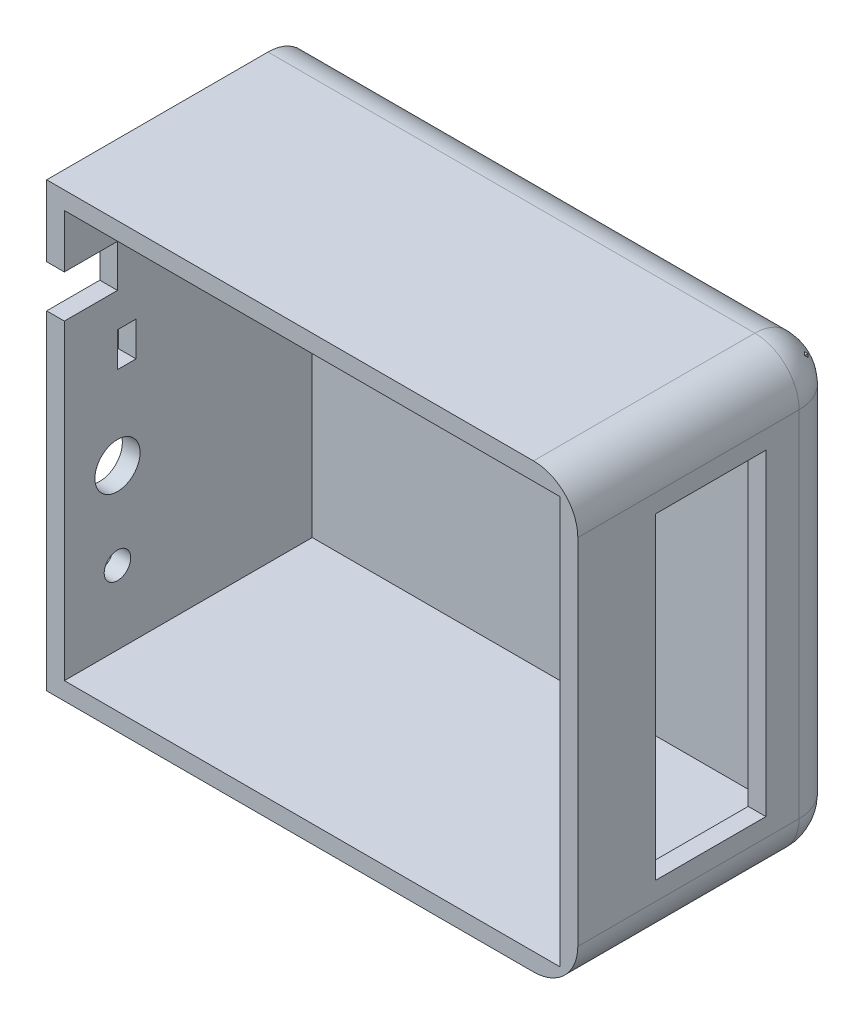
ISO-10303-21;
HEADER;
FILE_DESCRIPTION(('STEP AP214'),'2;1');
FILE_NAME('part.step','',(''),(''),'','','');
FILE_SCHEMA(('AUTOMOTIVE_DESIGN { 1 0 10303 214 1 1 1 1 }'));
ENDSEC;
DATA;
#1=APPLICATION_CONTEXT('core data for automotive mechanical design processes');
#2=APPLICATION_PROTOCOL_DEFINITION('international standard','automotive_design',2000,#1);
#3=PRODUCT_CONTEXT('',#1,'mechanical');
#4=PRODUCT('Part','Part','',(#3));
#5=PRODUCT_RELATED_PRODUCT_CATEGORY('part','',(#4));
#6=PRODUCT_DEFINITION_FORMATION('','',#4);
#7=PRODUCT_DEFINITION_CONTEXT('part definition',#1,'design');
#8=PRODUCT_DEFINITION('design','',#6,#7);
#9=PRODUCT_DEFINITION_SHAPE('','',#8);
#10=(LENGTH_UNIT() NAMED_UNIT(*) SI_UNIT(.MILLI.,.METRE.));
#11=(NAMED_UNIT(*) PLANE_ANGLE_UNIT() SI_UNIT($,.RADIAN.));
#12=(NAMED_UNIT(*) SI_UNIT($,.STERADIAN.) SOLID_ANGLE_UNIT());
#13=UNCERTAINTY_MEASURE_WITH_UNIT(LENGTH_MEASURE(1.E-05),#10,'distance_accuracy_value','');
#14=(GEOMETRIC_REPRESENTATION_CONTEXT(3) GLOBAL_UNCERTAINTY_ASSIGNED_CONTEXT((#13)) GLOBAL_UNIT_ASSIGNED_CONTEXT((#10,
#11,#12)) REPRESENTATION_CONTEXT('',''));
#15=CARTESIAN_POINT('',(0.,0.,0.));
#16=DIRECTION('',(0.,0.,1.));
#17=DIRECTION('',(1.,0.,0.));
#18=AXIS2_PLACEMENT_3D('',#15,#16,#17);
#19=CARTESIAN_POINT('',(0.,0.,4.));
#20=DIRECTION('',(1.,0.,0.));
#21=DIRECTION('',(0.,0.,-1.));
#22=AXIS2_PLACEMENT_3D('',#19,#20,#21);
#23=PLANE('',#22);
#24=CARTESIAN_POINT('',(0.,40.0941932592972,48.));
#25=DIRECTION('',(1.,0.,0.));
#26=DIRECTION('',(0.,0.,-1.));
#27=AXIS2_PLACEMENT_3D('',#24,#25,#26);
#28=CIRCLE('',#27,5.1);
#29=CARTESIAN_POINT('',(0.,40.0941932592972,42.9));
#30=VERTEX_POINT('',#29);
#31=EDGE_CURVE('E224',#30,#30,#28,.F.);
#32=ORIENTED_EDGE('',*,*,#31,.F.);
#33=EDGE_LOOP('',(#32));
#34=FACE_BOUND('',#33,.T.);
#35=DIRECTION('',(0.,1.,0.));
#36=VECTOR('',#35,1.);
#37=CARTESIAN_POINT('',(0.,0.,48.));
#38=LINE('',#37,#36);
#39=CARTESIAN_POINT('',(0.,74.357923225923,48.));
#40=VERTEX_POINT('',#39);
#41=CARTESIAN_POINT('',(0.,83.9579232259231,48.));
#42=VERTEX_POINT('',#41);
#43=EDGE_CURVE('E284',#40,#42,#38,.T.);
#44=ORIENTED_EDGE('',*,*,#43,.T.);
#45=DIRECTION('',(0.,0.,1.));
#46=VECTOR('',#45,1.);
#47=CARTESIAN_POINT('',(0.,83.9579232259231,4.));
#48=LINE('',#47,#46);
#49=CARTESIAN_POINT('',(0.,83.9579232259231,60.));
#50=VERTEX_POINT('',#49);
#51=EDGE_CURVE('E281',#42,#50,#48,.T.);
#52=ORIENTED_EDGE('',*,*,#51,.T.);
#53=DIRECTION('',(0.,-1.,0.));
#54=VECTOR('',#53,1.);
#55=CARTESIAN_POINT('',(0.,0.,60.));
#56=LINE('',#55,#54);
#57=CARTESIAN_POINT('',(0.,100.,60.));
#58=VERTEX_POINT('',#57);
#59=EDGE_CURVE('E325',#58,#50,#56,.T.);
#60=ORIENTED_EDGE('',*,*,#59,.F.);
#61=DIRECTION('',(0.,0.,-1.));
#62=VECTOR('',#61,1.);
#63=CARTESIAN_POINT('',(0.,100.,4.));
#64=LINE('',#63,#62);
#65=CARTESIAN_POINT('',(0.,100.,10.));
#66=VERTEX_POINT('',#65);
#67=EDGE_CURVE('E364',#58,#66,#64,.T.);
#68=ORIENTED_EDGE('',*,*,#67,.T.);
#69=CARTESIAN_POINT('',(0.,90.,10.));
#70=DIRECTION('',(1.,0.,0.));
#71=DIRECTION('',(0.,0.,-1.));
#72=AXIS2_PLACEMENT_3D('',#69,#70,#71);
#73=CIRCLE('',#72,10.);
#74=CARTESIAN_POINT('',(0.,90.,0.));
#75=VERTEX_POINT('',#74);
#76=EDGE_CURVE('E418',#66,#75,#73,.F.);
#77=ORIENTED_EDGE('',*,*,#76,.T.);
#78=DIRECTION('',(0.,-1.,0.));
#79=VECTOR('',#78,1.);
#80=CARTESIAN_POINT('',(0.,0.,0.));
#81=LINE('',#80,#79);
#82=CARTESIAN_POINT('',(0.,10.,0.));
#83=VERTEX_POINT('',#82);
#84=EDGE_CURVE('E362',#75,#83,#81,.T.);
#85=ORIENTED_EDGE('',*,*,#84,.T.);
#86=CARTESIAN_POINT('',(0.,10.,10.));
#87=DIRECTION('',(1.,0.,0.));
#88=DIRECTION('',(0.,0.,-1.));
#89=AXIS2_PLACEMENT_3D('',#86,#87,#88);
#90=CIRCLE('',#89,10.);
#91=CARTESIAN_POINT('',(0.,0.,10.));
#92=VERTEX_POINT('',#91);
#93=EDGE_CURVE('E400',#83,#92,#90,.F.);
#94=ORIENTED_EDGE('',*,*,#93,.T.);
#95=DIRECTION('',(0.,0.,-1.));
#96=VECTOR('',#95,1.);
#97=CARTESIAN_POINT('',(0.,0.,4.));
#98=LINE('',#97,#96);
#99=CARTESIAN_POINT('',(0.,0.,60.));
#100=VERTEX_POINT('',#99);
#101=EDGE_CURVE('E367',#100,#92,#98,.T.);
#102=ORIENTED_EDGE('',*,*,#101,.F.);
#103=CARTESIAN_POINT('',(0.,74.357923225923,60.));
#104=VERTEX_POINT('',#103);
#105=EDGE_CURVE('E324',#104,#100,#56,.T.);
#106=ORIENTED_EDGE('',*,*,#105,.F.);
#107=DIRECTION('',(0.,0.,1.));
#108=VECTOR('',#107,1.);
#109=CARTESIAN_POINT('',(0.,74.357923225923,4.));
#110=LINE('',#109,#108);
#111=EDGE_CURVE('E277',#40,#104,#110,.T.);
#112=ORIENTED_EDGE('',*,*,#111,.F.);
#113=EDGE_LOOP('',(#44,#52,#60,#68,#77,#85,#94,#102,#106,#112));
#114=FACE_BOUND('',#113,.T.);
#115=DIRECTION('',(0.,1.,0.));
#116=VECTOR('',#115,1.);
#117=CARTESIAN_POINT('',(0.,0.,48.));
#118=LINE('',#117,#116);
#119=CARTESIAN_POINT('',(0.,58.8579232259231,48.));
#120=VERTEX_POINT('',#119);
#121=CARTESIAN_POINT('',(0.,66.6579232259231,48.));
#122=VERTEX_POINT('',#121);
#123=EDGE_CURVE('E261',#120,#122,#118,.T.);
#124=ORIENTED_EDGE('',*,*,#123,.F.);
#125=DIRECTION('',(0.,0.,1.));
#126=VECTOR('',#125,1.);
#127=CARTESIAN_POINT('',(0.,58.8579232259231,4.));
#128=LINE('',#127,#126);
#129=CARTESIAN_POINT('',(0.,58.8579232259231,43.8));
#130=VERTEX_POINT('',#129);
#131=EDGE_CURVE('E247',#130,#120,#128,.T.);
#132=ORIENTED_EDGE('',*,*,#131,.F.);
#133=DIRECTION('',(0.,1.,0.));
#134=VECTOR('',#133,1.);
#135=CARTESIAN_POINT('',(0.,0.,43.8));
#136=LINE('',#135,#134);
#137=CARTESIAN_POINT('',(0.,66.6579232259231,43.8));
#138=VERTEX_POINT('',#137);
#139=EDGE_CURVE('E215',#130,#138,#136,.T.);
#140=ORIENTED_EDGE('',*,*,#139,.T.);
#141=DIRECTION('',(0.,0.,1.));
#142=VECTOR('',#141,1.);
#143=CARTESIAN_POINT('',(0.,66.6579232259231,4.));
#144=LINE('',#143,#142);
#145=EDGE_CURVE('E213',#138,#122,#144,.T.);
#146=ORIENTED_EDGE('',*,*,#145,.T.);
#147=EDGE_LOOP('',(#124,#132,#140,#146));
#148=FACE_BOUND('',#147,.T.);
#149=CARTESIAN_POINT('',(0.,20.5603193344936,48.));
#150=DIRECTION('',(1.,0.,0.));
#151=DIRECTION('',(0.,0.,-1.));
#152=AXIS2_PLACEMENT_3D('',#149,#150,#151);
#153=CIRCLE('',#152,3.);
#154=CARTESIAN_POINT('',(0.,20.5603193344936,45.));
#155=VERTEX_POINT('',#154);
#156=EDGE_CURVE('E225',#155,#155,#153,.F.);
#157=ORIENTED_EDGE('',*,*,#156,.F.);
#158=EDGE_LOOP('',(#157));
#159=FACE_BOUND('',#158,.T.);
#160=ADVANCED_FACE('F40',(#34,#114,#148,#159),#23,.F.);
#161=CARTESIAN_POINT('',(4.00000000000001,0.,60.));
#162=DIRECTION('',(1.,0.,0.));
#163=DIRECTION('',(0.,1.,0.));
#164=AXIS2_PLACEMENT_3D('',#161,#162,#163);
#165=PLANE('',#164);
#166=CARTESIAN_POINT('',(4.00000000000001,40.0941932592972,48.));
#167=DIRECTION('',(1.,0.,0.));
#168=DIRECTION('',(0.,1.,0.));
#169=AXIS2_PLACEMENT_3D('',#166,#167,#168);
#170=CIRCLE('',#169,5.1);
#171=CARTESIAN_POINT('',(4.00000000000001,45.1941932592972,48.));
#172=VERTEX_POINT('',#171);
#173=EDGE_CURVE('E222',#172,#172,#170,.F.);
#174=ORIENTED_EDGE('',*,*,#173,.T.);
#175=EDGE_LOOP('',(#174));
#176=FACE_BOUND('',#175,.T.);
#177=DIRECTION('',(0.,0.,1.));
#178=VECTOR('',#177,1.);
#179=CARTESIAN_POINT('',(4.,83.9579232259231,60.));
#180=LINE('',#179,#178);
#181=CARTESIAN_POINT('',(4.,83.9579232259231,48.));
#182=VERTEX_POINT('',#181);
#183=CARTESIAN_POINT('',(4.00000000000001,83.9579232259231,60.));
#184=VERTEX_POINT('',#183);
#185=EDGE_CURVE('E278',#182,#184,#180,.T.);
#186=ORIENTED_EDGE('',*,*,#185,.F.);
#187=DIRECTION('',(0.,1.,0.));
#188=VECTOR('',#187,1.);
#189=CARTESIAN_POINT('',(4.00000000000001,0.,48.));
#190=LINE('',#189,#188);
#191=CARTESIAN_POINT('',(4.,74.357923225923,48.));
#192=VERTEX_POINT('',#191);
#193=EDGE_CURVE('E206',#192,#182,#190,.T.);
#194=ORIENTED_EDGE('',*,*,#193,.F.);
#195=DIRECTION('',(0.,0.,1.));
#196=VECTOR('',#195,1.);
#197=CARTESIAN_POINT('',(4.,74.357923225923,60.));
#198=LINE('',#197,#196);
#199=CARTESIAN_POINT('',(4.00000000000001,74.357923225923,60.));
#200=VERTEX_POINT('',#199);
#201=EDGE_CURVE('E274',#192,#200,#198,.T.);
#202=ORIENTED_EDGE('',*,*,#201,.T.);
#203=DIRECTION('',(0.,-1.,0.));
#204=VECTOR('',#203,1.);
#205=CARTESIAN_POINT('',(4.00000000000001,0.,60.));
#206=LINE('',#205,#204);
#207=CARTESIAN_POINT('',(4.00000000000001,3.99999999999999,60.));
#208=VERTEX_POINT('',#207);
#209=EDGE_CURVE('E328',#200,#208,#206,.T.);
#210=ORIENTED_EDGE('',*,*,#209,.T.);
#211=DIRECTION('',(0.,0.,-1.));
#212=VECTOR('',#211,1.);
#213=CARTESIAN_POINT('',(4.00000000000001,3.99999999999999,60.));
#214=LINE('',#213,#212);
#215=CARTESIAN_POINT('',(4.00000000000001,3.99999999999999,4.));
#216=VERTEX_POINT('',#215);
#217=EDGE_CURVE('E340',#208,#216,#214,.T.);
#218=ORIENTED_EDGE('',*,*,#217,.T.);
#219=DIRECTION('',(0.,-1.,0.));
#220=VECTOR('',#219,1.);
#221=CARTESIAN_POINT('',(4.00000000000001,0.,4.));
#222=LINE('',#221,#220);
#223=CARTESIAN_POINT('',(4.,96.,4.));
#224=VERTEX_POINT('',#223);
#225=EDGE_CURVE('E359',#224,#216,#222,.T.);
#226=ORIENTED_EDGE('',*,*,#225,.F.);
#227=DIRECTION('',(0.,0.,-1.));
#228=VECTOR('',#227,1.);
#229=CARTESIAN_POINT('',(4.,96.,60.));
#230=LINE('',#229,#228);
#231=CARTESIAN_POINT('',(4.,96.,60.));
#232=VERTEX_POINT('',#231);
#233=EDGE_CURVE('E348',#232,#224,#230,.T.);
#234=ORIENTED_EDGE('',*,*,#233,.F.);
#235=EDGE_CURVE('E329',#232,#184,#206,.T.);
#236=ORIENTED_EDGE('',*,*,#235,.T.);
#237=EDGE_LOOP('',(#186,#194,#202,#210,#218,#226,#234,#236));
#238=FACE_BOUND('',#237,.T.);
#239=DIRECTION('',(0.,0.,1.));
#240=VECTOR('',#239,1.);
#241=CARTESIAN_POINT('',(4.00000000000001,58.8579232259231,60.));
#242=LINE('',#241,#240);
#243=CARTESIAN_POINT('',(4.00000000000001,58.8579232259231,43.8));
#244=VERTEX_POINT('',#243);
#245=CARTESIAN_POINT('',(4.00000000000001,58.8579232259231,48.));
#246=VERTEX_POINT('',#245);
#247=EDGE_CURVE('E49',#244,#246,#242,.T.);
#248=ORIENTED_EDGE('',*,*,#247,.T.);
#249=DIRECTION('',(0.,1.,0.));
#250=VECTOR('',#249,1.);
#251=CARTESIAN_POINT('',(4.00000000000001,0.,48.));
#252=LINE('',#251,#250);
#253=CARTESIAN_POINT('',(4.,66.6579232259231,48.));
#254=VERTEX_POINT('',#253);
#255=EDGE_CURVE('E12',#246,#254,#252,.T.);
#256=ORIENTED_EDGE('',*,*,#255,.T.);
#257=DIRECTION('',(0.,0.,1.));
#258=VECTOR('',#257,1.);
#259=CARTESIAN_POINT('',(4.,66.6579232259231,60.));
#260=LINE('',#259,#258);
#261=CARTESIAN_POINT('',(4.,66.6579232259231,43.8));
#262=VERTEX_POINT('',#261);
#263=EDGE_CURVE('E205',#262,#254,#260,.T.);
#264=ORIENTED_EDGE('',*,*,#263,.F.);
#265=DIRECTION('',(0.,1.,0.));
#266=VECTOR('',#265,1.);
#267=CARTESIAN_POINT('',(4.00000000000001,0.,43.8));
#268=LINE('',#267,#266);
#269=EDGE_CURVE('E200',#244,#262,#268,.T.);
#270=ORIENTED_EDGE('',*,*,#269,.F.);
#271=EDGE_LOOP('',(#248,#256,#264,#270));
#272=FACE_BOUND('',#271,.T.);
#273=CARTESIAN_POINT('',(4.00000000000001,20.5603193344936,48.));
#274=DIRECTION('',(1.,0.,0.));
#275=DIRECTION('',(0.,1.,0.));
#276=AXIS2_PLACEMENT_3D('',#273,#274,#275);
#277=CIRCLE('',#276,3.);
#278=CARTESIAN_POINT('',(4.00000000000001,23.5603193344936,48.));
#279=VERTEX_POINT('',#278);
#280=EDGE_CURVE('E44',#279,#279,#277,.F.);
#281=ORIENTED_EDGE('',*,*,#280,.T.);
#282=EDGE_LOOP('',(#281));
#283=FACE_BOUND('',#282,.T.);
#284=ADVANCED_FACE('F217',(#176,#238,#272,#283),#165,.T.);
#285=CARTESIAN_POINT('',(120.,0.,4.));
#286=DIRECTION('',(-1.,0.,0.));
#287=DIRECTION('',(0.,0.,1.));
#288=AXIS2_PLACEMENT_3D('',#285,#286,#287);
#289=PLANE('',#288);
#290=DIRECTION('',(0.,1.,0.));
#291=VECTOR('',#290,1.);
#292=CARTESIAN_POINT('',(120.,100.,10.));
#293=LINE('',#292,#291);
#294=CARTESIAN_POINT('',(120.,9.99999999999999,10.));
#295=VERTEX_POINT('',#294);
#296=CARTESIAN_POINT('',(120.,90.,10.));
#297=VERTEX_POINT('',#296);
#298=EDGE_CURVE('E379',#295,#297,#293,.T.);
#299=ORIENTED_EDGE('',*,*,#298,.T.);
#300=DIRECTION('',(0.,0.,-1.));
#301=VECTOR('',#300,1.);
#302=CARTESIAN_POINT('',(120.,90.,4.));
#303=LINE('',#302,#301);
#304=CARTESIAN_POINT('',(120.,90.,60.));
#305=VERTEX_POINT('',#304);
#306=EDGE_CURVE('E412',#297,#305,#303,.F.);
#307=ORIENTED_EDGE('',*,*,#306,.T.);
#308=DIRECTION('',(0.,-1.,0.));
#309=VECTOR('',#308,1.);
#310=CARTESIAN_POINT('',(120.,0.,60.));
#311=LINE('',#310,#309);
#312=CARTESIAN_POINT('',(120.,10.,60.));
#313=VERTEX_POINT('',#312);
#314=EDGE_CURVE('E319',#305,#313,#311,.T.);
#315=ORIENTED_EDGE('',*,*,#314,.T.);
#316=DIRECTION('',(0.,0.,-1.));
#317=VECTOR('',#316,1.);
#318=CARTESIAN_POINT('',(120.,10.,4.));
#319=LINE('',#318,#317);
#320=EDGE_CURVE('E384',#313,#295,#319,.T.);
#321=ORIENTED_EDGE('',*,*,#320,.T.);
#322=EDGE_LOOP('',(#299,#307,#315,#321));
#323=FACE_BOUND('',#322,.T.);
#324=DIRECTION('',(0.,0.,-1.));
#325=VECTOR('',#324,1.);
#326=CARTESIAN_POINT('',(120.,14.15,4.));
#327=LINE('',#326,#325);
#328=CARTESIAN_POINT('',(120.,14.15,42.5));
#329=VERTEX_POINT('',#328);
#330=CARTESIAN_POINT('',(120.,14.15,17.5));
#331=VERTEX_POINT('',#330);
#332=EDGE_CURVE('E314',#329,#331,#327,.T.);
#333=ORIENTED_EDGE('',*,*,#332,.F.);
#334=DIRECTION('',(0.,-1.,0.));
#335=VECTOR('',#334,1.);
#336=CARTESIAN_POINT('',(120.,0.,42.5));
#337=LINE('',#336,#335);
#338=CARTESIAN_POINT('',(120.,85.85,42.5));
#339=VERTEX_POINT('',#338);
#340=EDGE_CURVE('E301',#339,#329,#337,.T.);
#341=ORIENTED_EDGE('',*,*,#340,.F.);
#342=DIRECTION('',(0.,0.,1.));
#343=VECTOR('',#342,1.);
#344=CARTESIAN_POINT('',(120.,85.85,4.));
#345=LINE('',#344,#343);
#346=CARTESIAN_POINT('',(120.,85.85,17.5));
#347=VERTEX_POINT('',#346);
#348=EDGE_CURVE('E303',#347,#339,#345,.T.);
#349=ORIENTED_EDGE('',*,*,#348,.F.);
#350=DIRECTION('',(0.,1.,0.));
#351=VECTOR('',#350,1.);
#352=CARTESIAN_POINT('',(120.,0.,17.5));
#353=LINE('',#352,#351);
#354=EDGE_CURVE('E312',#331,#347,#353,.T.);
#355=ORIENTED_EDGE('',*,*,#354,.F.);
#356=EDGE_LOOP('',(#333,#341,#349,#355));
#357=FACE_BOUND('',#356,.T.);
#358=ADVANCED_FACE('F468',(#323,#357),#289,.F.);
#359=CARTESIAN_POINT('',(116.,0.,60.));
#360=DIRECTION('',(1.,0.,0.));
#361=DIRECTION('',(0.,1.,0.));
#362=AXIS2_PLACEMENT_3D('',#359,#360,#361);
#363=PLANE('',#362);
#364=DIRECTION('',(0.,0.,-1.));
#365=VECTOR('',#364,1.);
#366=CARTESIAN_POINT('',(116.,96.,60.));
#367=LINE('',#366,#365);
#368=CARTESIAN_POINT('',(116.,96.,60.));
#369=VERTEX_POINT('',#368);
#370=CARTESIAN_POINT('',(116.,96.,4.));
#371=VERTEX_POINT('',#370);
#372=EDGE_CURVE('E345',#369,#371,#367,.T.);
#373=ORIENTED_EDGE('',*,*,#372,.T.);
#374=DIRECTION('',(0.,-1.,0.));
#375=VECTOR('',#374,1.);
#376=CARTESIAN_POINT('',(116.,0.,4.));
#377=LINE('',#376,#375);
#378=CARTESIAN_POINT('',(116.,3.99999999999999,4.));
#379=VERTEX_POINT('',#378);
#380=EDGE_CURVE('E354',#371,#379,#377,.T.);
#381=ORIENTED_EDGE('',*,*,#380,.T.);
#382=DIRECTION('',(0.,0.,-1.));
#383=VECTOR('',#382,1.);
#384=CARTESIAN_POINT('',(116.,3.99999999999999,60.));
#385=LINE('',#384,#383);
#386=CARTESIAN_POINT('',(116.,3.99999999999999,60.));
#387=VERTEX_POINT('',#386);
#388=EDGE_CURVE('E343',#387,#379,#385,.T.);
#389=ORIENTED_EDGE('',*,*,#388,.F.);
#390=DIRECTION('',(0.,-1.,0.));
#391=VECTOR('',#390,1.);
#392=CARTESIAN_POINT('',(116.,0.,60.));
#393=LINE('',#392,#391);
#394=EDGE_CURVE('E335',#369,#387,#393,.T.);
#395=ORIENTED_EDGE('',*,*,#394,.F.);
#396=EDGE_LOOP('',(#373,#381,#389,#395));
#397=FACE_BOUND('',#396,.T.);
#398=DIRECTION('',(0.,0.,1.));
#399=VECTOR('',#398,1.);
#400=CARTESIAN_POINT('',(116.,14.15,60.));
#401=LINE('',#400,#399);
#402=CARTESIAN_POINT('',(116.,14.15,17.5));
#403=VERTEX_POINT('',#402);
#404=CARTESIAN_POINT('',(116.,14.15,42.5));
#405=VERTEX_POINT('',#404);
#406=EDGE_CURVE('E376',#403,#405,#401,.T.);
#407=ORIENTED_EDGE('',*,*,#406,.F.);
#408=DIRECTION('',(0.,-1.,0.));
#409=VECTOR('',#408,1.);
#410=CARTESIAN_POINT('',(116.,0.,17.5));
#411=LINE('',#410,#409);
#412=CARTESIAN_POINT('',(116.,85.85,17.5));
#413=VERTEX_POINT('',#412);
#414=EDGE_CURVE('E374',#413,#403,#411,.T.);
#415=ORIENTED_EDGE('',*,*,#414,.F.);
#416=DIRECTION('',(0.,0.,-1.));
#417=VECTOR('',#416,1.);
#418=CARTESIAN_POINT('',(116.,85.85,60.));
#419=LINE('',#418,#417);
#420=CARTESIAN_POINT('',(116.,85.85,42.5));
#421=VERTEX_POINT('',#420);
#422=EDGE_CURVE('E372',#421,#413,#419,.T.);
#423=ORIENTED_EDGE('',*,*,#422,.F.);
#424=DIRECTION('',(0.,1.,0.));
#425=VECTOR('',#424,1.);
#426=CARTESIAN_POINT('',(116.,0.,42.5));
#427=LINE('',#426,#425);
#428=EDGE_CURVE('E370',#405,#421,#427,.T.);
#429=ORIENTED_EDGE('',*,*,#428,.F.);
#430=EDGE_LOOP('',(#407,#415,#423,#429));
#431=FACE_BOUND('',#430,.T.);
#432=ADVANCED_FACE('F464',(#397,#431),#363,.F.);
#433=CARTESIAN_POINT('',(0.,0.,4.));
#434=DIRECTION('',(0.,1.,0.));
#435=DIRECTION('',(0.,0.,1.));
#436=AXIS2_PLACEMENT_3D('',#433,#434,#435);
#437=PLANE('',#436);
#438=DIRECTION('',(1.,0.,0.));
#439=VECTOR('',#438,1.);
#440=CARTESIAN_POINT('',(110.,0.,10.));
#441=LINE('',#440,#439);
#442=CARTESIAN_POINT('',(110.,0.,10.));
#443=VERTEX_POINT('',#442);
#444=EDGE_CURVE('E387',#92,#443,#441,.T.);
#445=ORIENTED_EDGE('',*,*,#444,.T.);
#446=DIRECTION('',(0.,0.,-1.));
#447=VECTOR('',#446,1.);
#448=CARTESIAN_POINT('',(110.,0.,4.));
#449=LINE('',#448,#447);
#450=CARTESIAN_POINT('',(110.,0.,60.));
#451=VERTEX_POINT('',#450);
#452=EDGE_CURVE('E389',#443,#451,#449,.F.);
#453=ORIENTED_EDGE('',*,*,#452,.T.);
#454=DIRECTION('',(1.,0.,0.));
#455=VECTOR('',#454,1.);
#456=CARTESIAN_POINT('',(0.,0.,60.));
#457=LINE('',#456,#455);
#458=EDGE_CURVE('E316',#100,#451,#457,.T.);
#459=ORIENTED_EDGE('',*,*,#458,.F.);
#460=ORIENTED_EDGE('',*,*,#101,.T.);
#461=EDGE_LOOP('',(#445,#453,#459,#460));
#462=FACE_BOUND('',#461,.T.);
#463=ADVANCED_FACE('F467',(#462),#437,.F.);
#464=CARTESIAN_POINT('',(0.,100.,4.));
#465=DIRECTION('',(0.,-1.,0.));
#466=DIRECTION('',(0.,0.,-1.));
#467=AXIS2_PLACEMENT_3D('',#464,#465,#466);
#468=PLANE('',#467);
#469=DIRECTION('',(1.,0.,0.));
#470=VECTOR('',#469,1.);
#471=CARTESIAN_POINT('',(0.,100.,60.));
#472=LINE('',#471,#470);
#473=CARTESIAN_POINT('',(110.,100.,60.));
#474=VERTEX_POINT('',#473);
#475=EDGE_CURVE('E321',#58,#474,#472,.T.);
#476=ORIENTED_EDGE('',*,*,#475,.T.);
#477=DIRECTION('',(0.,0.,-1.));
#478=VECTOR('',#477,1.);
#479=CARTESIAN_POINT('',(110.,100.,4.));
#480=LINE('',#479,#478);
#481=CARTESIAN_POINT('',(110.,100.,10.));
#482=VERTEX_POINT('',#481);
#483=EDGE_CURVE('E409',#474,#482,#480,.T.);
#484=ORIENTED_EDGE('',*,*,#483,.T.);
#485=DIRECTION('',(-1.,0.,0.));
#486=VECTOR('',#485,1.);
#487=CARTESIAN_POINT('',(0.,100.,10.));
#488=LINE('',#487,#486);
#489=EDGE_CURVE('E402',#482,#66,#488,.T.);
#490=ORIENTED_EDGE('',*,*,#489,.T.);
#491=ORIENTED_EDGE('',*,*,#67,.F.);
#492=EDGE_LOOP('',(#476,#484,#490,#491));
#493=FACE_BOUND('',#492,.T.);
#494=ADVANCED_FACE('F548',(#493),#468,.F.);
#495=CARTESIAN_POINT('',(0.,0.,0.));
#496=DIRECTION('',(0.,0.,-1.));
#497=DIRECTION('',(-1.,0.,0.));
#498=AXIS2_PLACEMENT_3D('',#495,#496,#497);
#499=PLANE('',#498);
#500=ORIENTED_EDGE('',*,*,#84,.F.);
#501=DIRECTION('',(-1.,0.,0.));
#502=VECTOR('',#501,1.);
#503=CARTESIAN_POINT('',(110.,90.,0.));
#504=LINE('',#503,#502);
#505=CARTESIAN_POINT('',(110.,90.,0.));
#506=VERTEX_POINT('',#505);
#507=EDGE_CURVE('E420',#75,#506,#504,.F.);
#508=ORIENTED_EDGE('',*,*,#507,.T.);
#509=DIRECTION('',(0.,1.,0.));
#510=VECTOR('',#509,1.);
#511=CARTESIAN_POINT('',(110.,0.,0.));
#512=LINE('',#511,#510);
#513=CARTESIAN_POINT('',(110.,10.,0.));
#514=VERTEX_POINT('',#513);
#515=EDGE_CURVE('E382',#506,#514,#512,.F.);
#516=ORIENTED_EDGE('',*,*,#515,.T.);
#517=DIRECTION('',(1.,0.,0.));
#518=VECTOR('',#517,1.);
#519=CARTESIAN_POINT('',(0.,10.,0.));
#520=LINE('',#519,#518);
#521=EDGE_CURVE('E397',#514,#83,#520,.F.);
#522=ORIENTED_EDGE('',*,*,#521,.T.);
#523=EDGE_LOOP('',(#500,#508,#516,#522));
#524=FACE_BOUND('',#523,.T.);
#525=ADVANCED_FACE('F553',(#524),#499,.T.);
#526=CARTESIAN_POINT('',(0.,96.,60.));
#527=DIRECTION('',(0.,1.,0.));
#528=DIRECTION('',(0.,0.,1.));
#529=AXIS2_PLACEMENT_3D('',#526,#527,#528);
#530=PLANE('',#529);
#531=ORIENTED_EDGE('',*,*,#233,.T.);
#532=DIRECTION('',(1.,0.,0.));
#533=VECTOR('',#532,1.);
#534=CARTESIAN_POINT('',(0.,96.,4.));
#535=LINE('',#534,#533);
#536=EDGE_CURVE('E357',#224,#371,#535,.T.);
#537=ORIENTED_EDGE('',*,*,#536,.T.);
#538=ORIENTED_EDGE('',*,*,#372,.F.);
#539=DIRECTION('',(1.,0.,0.));
#540=VECTOR('',#539,1.);
#541=CARTESIAN_POINT('',(0.,96.,60.));
#542=LINE('',#541,#540);
#543=EDGE_CURVE('E332',#232,#369,#542,.T.);
#544=ORIENTED_EDGE('',*,*,#543,.F.);
#545=EDGE_LOOP('',(#531,#537,#538,#544));
#546=FACE_BOUND('',#545,.T.);
#547=ADVANCED_FACE('F462',(#546),#530,.F.);
#548=CARTESIAN_POINT('',(0.,3.99999999999999,60.));
#549=DIRECTION('',(0.,1.,0.));
#550=DIRECTION('',(0.,0.,1.));
#551=AXIS2_PLACEMENT_3D('',#548,#549,#550);
#552=PLANE('',#551);
#553=DIRECTION('',(1.,0.,0.));
#554=VECTOR('',#553,1.);
#555=CARTESIAN_POINT('',(0.,3.99999999999999,4.));
#556=LINE('',#555,#554);
#557=EDGE_CURVE('E351',#216,#379,#556,.T.);
#558=ORIENTED_EDGE('',*,*,#557,.F.);
#559=ORIENTED_EDGE('',*,*,#217,.F.);
#560=DIRECTION('',(1.,0.,0.));
#561=VECTOR('',#560,1.);
#562=CARTESIAN_POINT('',(0.,3.99999999999999,60.));
#563=LINE('',#562,#561);
#564=EDGE_CURVE('E337',#208,#387,#563,.T.);
#565=ORIENTED_EDGE('',*,*,#564,.T.);
#566=ORIENTED_EDGE('',*,*,#388,.T.);
#567=EDGE_LOOP('',(#558,#559,#565,#566));
#568=FACE_BOUND('',#567,.T.);
#569=ADVANCED_FACE('F456',(#568),#552,.T.);
#570=CARTESIAN_POINT('',(0.,0.,60.));
#571=DIRECTION('',(0.,0.,1.));
#572=DIRECTION('',(1.,0.,0.));
#573=AXIS2_PLACEMENT_3D('',#570,#571,#572);
#574=PLANE('',#573);
#575=DIRECTION('',(-1.,0.,0.));
#576=VECTOR('',#575,1.);
#577=CARTESIAN_POINT('',(0.,83.9579232259231,60.));
#578=LINE('',#577,#576);
#579=EDGE_CURVE('E428',#184,#50,#578,.T.);
#580=ORIENTED_EDGE('',*,*,#579,.F.);
#581=ORIENTED_EDGE('',*,*,#235,.F.);
#582=ORIENTED_EDGE('',*,*,#543,.T.);
#583=ORIENTED_EDGE('',*,*,#394,.T.);
#584=ORIENTED_EDGE('',*,*,#564,.F.);
#585=ORIENTED_EDGE('',*,*,#209,.F.);
#586=DIRECTION('',(-1.,0.,0.));
#587=VECTOR('',#586,1.);
#588=CARTESIAN_POINT('',(0.,74.357923225923,60.));
#589=LINE('',#588,#587);
#590=EDGE_CURVE('E422',#200,#104,#589,.T.);
#591=ORIENTED_EDGE('',*,*,#590,.T.);
#592=ORIENTED_EDGE('',*,*,#105,.T.);
#593=ORIENTED_EDGE('',*,*,#458,.T.);
#594=CARTESIAN_POINT('',(110.,10.,60.));
#595=DIRECTION('',(0.,0.,1.));
#596=DIRECTION('',(1.,0.,0.));
#597=AXIS2_PLACEMENT_3D('',#594,#595,#596);
#598=CIRCLE('',#597,10.);
#599=EDGE_CURVE('E391',#451,#313,#598,.T.);
#600=ORIENTED_EDGE('',*,*,#599,.T.);
#601=ORIENTED_EDGE('',*,*,#314,.F.);
#602=CARTESIAN_POINT('',(110.,90.,60.));
#603=DIRECTION('',(0.,0.,1.));
#604=DIRECTION('',(1.,0.,0.));
#605=AXIS2_PLACEMENT_3D('',#602,#603,#604);
#606=CIRCLE('',#605,10.);
#607=EDGE_CURVE('E414',#305,#474,#606,.T.);
#608=ORIENTED_EDGE('',*,*,#607,.T.);
#609=ORIENTED_EDGE('',*,*,#475,.F.);
#610=ORIENTED_EDGE('',*,*,#59,.T.);
#611=EDGE_LOOP('',(#580,#581,#582,#583,#584,#585,#591,#592,#593,#600,#601,#608,#609,#610));
#612=FACE_BOUND('',#611,.T.);
#613=ADVANCED_FACE('F442',(#612),#574,.T.);
#614=CARTESIAN_POINT('',(0.,0.,4.));
#615=DIRECTION('',(0.,0.,-1.));
#616=DIRECTION('',(-1.,0.,0.));
#617=AXIS2_PLACEMENT_3D('',#614,#615,#616);
#618=PLANE('',#617);
#619=ORIENTED_EDGE('',*,*,#536,.F.);
#620=ORIENTED_EDGE('',*,*,#225,.T.);
#621=ORIENTED_EDGE('',*,*,#557,.T.);
#622=ORIENTED_EDGE('',*,*,#380,.F.);
#623=EDGE_LOOP('',(#619,#620,#621,#622));
#624=FACE_BOUND('',#623,.T.);
#625=ADVANCED_FACE('F459',(#624),#618,.F.);
#626=CARTESIAN_POINT('',(120.,14.15,17.5));
#627=DIRECTION('',(0.,1.,0.));
#628=DIRECTION('',(0.,0.,1.));
#629=AXIS2_PLACEMENT_3D('',#626,#627,#628);
#630=PLANE('',#629);
#631=ORIENTED_EDGE('',*,*,#332,.T.);
#632=DIRECTION('',(1.,0.,0.));
#633=VECTOR('',#632,1.);
#634=CARTESIAN_POINT('',(120.,14.15,17.5));
#635=LINE('',#634,#633);
#636=EDGE_CURVE('E298',#403,#331,#635,.T.);
#637=ORIENTED_EDGE('',*,*,#636,.F.);
#638=ORIENTED_EDGE('',*,*,#406,.T.);
#639=DIRECTION('',(1.,0.,0.));
#640=VECTOR('',#639,1.);
#641=CARTESIAN_POINT('',(120.,14.15,42.5));
#642=LINE('',#641,#640);
#643=EDGE_CURVE('E293',#405,#329,#642,.T.);
#644=ORIENTED_EDGE('',*,*,#643,.T.);
#645=EDGE_LOOP('',(#631,#637,#638,#644));
#646=FACE_BOUND('',#645,.T.);
#647=ADVANCED_FACE('F476',(#646),#630,.T.);
#648=CARTESIAN_POINT('',(120.,14.15,17.5));
#649=DIRECTION('',(0.,0.,1.));
#650=DIRECTION('',(1.,0.,0.));
#651=AXIS2_PLACEMENT_3D('',#648,#649,#650);
#652=PLANE('',#651);
#653=ORIENTED_EDGE('',*,*,#354,.T.);
#654=DIRECTION('',(1.,0.,0.));
#655=VECTOR('',#654,1.);
#656=CARTESIAN_POINT('',(120.,85.85,17.5));
#657=LINE('',#656,#655);
#658=EDGE_CURVE('E297',#413,#347,#657,.T.);
#659=ORIENTED_EDGE('',*,*,#658,.F.);
#660=ORIENTED_EDGE('',*,*,#414,.T.);
#661=ORIENTED_EDGE('',*,*,#636,.T.);
#662=EDGE_LOOP('',(#653,#659,#660,#661));
#663=FACE_BOUND('',#662,.T.);
#664=ADVANCED_FACE('F480',(#663),#652,.T.);
#665=CARTESIAN_POINT('',(120.,85.85,17.5));
#666=DIRECTION('',(0.,-1.,0.));
#667=DIRECTION('',(0.,0.,-1.));
#668=AXIS2_PLACEMENT_3D('',#665,#666,#667);
#669=PLANE('',#668);
#670=ORIENTED_EDGE('',*,*,#348,.T.);
#671=DIRECTION('',(1.,0.,0.));
#672=VECTOR('',#671,1.);
#673=CARTESIAN_POINT('',(120.,85.85,42.5));
#674=LINE('',#673,#672);
#675=EDGE_CURVE('E299',#421,#339,#674,.T.);
#676=ORIENTED_EDGE('',*,*,#675,.F.);
#677=ORIENTED_EDGE('',*,*,#422,.T.);
#678=ORIENTED_EDGE('',*,*,#658,.T.);
#679=EDGE_LOOP('',(#670,#676,#677,#678));
#680=FACE_BOUND('',#679,.T.);
#681=ADVANCED_FACE('F488',(#680),#669,.T.);
#682=CARTESIAN_POINT('',(120.,14.15,42.5));
#683=DIRECTION('',(0.,0.,-1.));
#684=DIRECTION('',(-1.,0.,0.));
#685=AXIS2_PLACEMENT_3D('',#682,#683,#684);
#686=PLANE('',#685);
#687=ORIENTED_EDGE('',*,*,#340,.T.);
#688=ORIENTED_EDGE('',*,*,#643,.F.);
#689=ORIENTED_EDGE('',*,*,#428,.T.);
#690=ORIENTED_EDGE('',*,*,#675,.T.);
#691=EDGE_LOOP('',(#687,#688,#689,#690));
#692=FACE_BOUND('',#691,.T.);
#693=ADVANCED_FACE('F490',(#692),#686,.T.);
#694=CARTESIAN_POINT('',(110.,0.,10.));
#695=DIRECTION('',(0.,-1.,0.));
#696=DIRECTION('',(0.,0.,-1.));
#697=AXIS2_PLACEMENT_3D('',#694,#695,#696);
#698=CYLINDRICAL_SURFACE('',#697,10.);
#699=ORIENTED_EDGE('',*,*,#515,.F.);
#700=CARTESIAN_POINT('',(110.,90.,10.));
#701=DIRECTION('',(0.,-1.,0.));
#702=DIRECTION('',(0.,0.,-1.));
#703=AXIS2_PLACEMENT_3D('',#700,#701,#702);
#704=CIRCLE('',#703,10.);
#705=EDGE_CURVE('E416',#506,#297,#704,.T.);
#706=ORIENTED_EDGE('',*,*,#705,.T.);
#707=ORIENTED_EDGE('',*,*,#298,.F.);
#708=CARTESIAN_POINT('',(110.,10.,10.));
#709=DIRECTION('',(0.,-1.,0.));
#710=DIRECTION('',(0.,0.,-1.));
#711=AXIS2_PLACEMENT_3D('',#708,#709,#710);
#712=CIRCLE('',#711,10.);
#713=EDGE_CURVE('E394',#295,#514,#712,.F.);
#714=ORIENTED_EDGE('',*,*,#713,.T.);
#715=EDGE_LOOP('',(#699,#706,#707,#714));
#716=FACE_BOUND('',#715,.T.);
#717=ADVANCED_FACE('F492',(#716),#698,.T.);
#718=CARTESIAN_POINT('',(0.,10.,10.));
#719=DIRECTION('',(-1.,0.,0.));
#720=DIRECTION('',(0.,0.,1.));
#721=AXIS2_PLACEMENT_3D('',#718,#719,#720);
#722=CYLINDRICAL_SURFACE('',#721,10.);
#723=ORIENTED_EDGE('',*,*,#93,.F.);
#724=ORIENTED_EDGE('',*,*,#521,.F.);
#725=CARTESIAN_POINT('',(110.,10.,10.));
#726=DIRECTION('',(1.,0.,0.));
#727=DIRECTION('',(0.,0.,-1.));
#728=AXIS2_PLACEMENT_3D('',#725,#726,#727);
#729=CIRCLE('',#728,10.);
#730=EDGE_CURVE('E311',#443,#514,#729,.T.);
#731=ORIENTED_EDGE('',*,*,#730,.F.);
#732=ORIENTED_EDGE('',*,*,#444,.F.);
#733=EDGE_LOOP('',(#723,#724,#731,#732));
#734=FACE_BOUND('',#733,.T.);
#735=ADVANCED_FACE('F498',(#734),#722,.T.);
#736=CARTESIAN_POINT('',(110.,10.,10.));
#737=DIRECTION('',(0.,0.,1.));
#738=DIRECTION('',(1.,0.,0.));
#739=AXIS2_PLACEMENT_3D('',#736,#737,#738);
#740=SPHERICAL_SURFACE('',#739,10.);
#741=ORIENTED_EDGE('',*,*,#730,.T.);
#742=ORIENTED_EDGE('',*,*,#713,.F.);
#743=CARTESIAN_POINT('',(110.,10.,10.));
#744=DIRECTION('',(0.,0.,1.));
#745=DIRECTION('',(1.,0.,0.));
#746=AXIS2_PLACEMENT_3D('',#743,#744,#745);
#747=CIRCLE('',#746,10.);
#748=EDGE_CURVE('E403',#443,#295,#747,.T.);
#749=ORIENTED_EDGE('',*,*,#748,.F.);
#750=EDGE_LOOP('',(#741,#742,#749));
#751=FACE_BOUND('',#750,.T.);
#752=ADVANCED_FACE('F517',(#751),#740,.T.);
#753=CARTESIAN_POINT('',(110.,10.,4.));
#754=DIRECTION('',(0.,0.,-1.));
#755=DIRECTION('',(-1.,0.,0.));
#756=AXIS2_PLACEMENT_3D('',#753,#754,#755);
#757=CYLINDRICAL_SURFACE('',#756,10.);
#758=ORIENTED_EDGE('',*,*,#599,.F.);
#759=ORIENTED_EDGE('',*,*,#452,.F.);
#760=ORIENTED_EDGE('',*,*,#748,.T.);
#761=ORIENTED_EDGE('',*,*,#320,.F.);
#762=EDGE_LOOP('',(#758,#759,#760,#761));
#763=FACE_BOUND('',#762,.T.);
#764=ADVANCED_FACE('F514',(#763),#757,.T.);
#765=CARTESIAN_POINT('',(0.,90.,10.));
#766=DIRECTION('',(1.,0.,0.));
#767=DIRECTION('',(0.,0.,-1.));
#768=AXIS2_PLACEMENT_3D('',#765,#766,#767);
#769=CYLINDRICAL_SURFACE('',#768,10.);
#770=CARTESIAN_POINT('',(110.,90.,10.));
#771=DIRECTION('',(1.,0.,0.));
#772=DIRECTION('',(0.,0.,-1.));
#773=AXIS2_PLACEMENT_3D('',#770,#771,#772);
#774=CIRCLE('',#773,10.);
#775=EDGE_CURVE('E405',#506,#482,#774,.T.);
#776=ORIENTED_EDGE('',*,*,#775,.F.);
#777=ORIENTED_EDGE('',*,*,#507,.F.);
#778=ORIENTED_EDGE('',*,*,#76,.F.);
#779=ORIENTED_EDGE('',*,*,#489,.F.);
#780=EDGE_LOOP('',(#776,#777,#778,#779));
#781=FACE_BOUND('',#780,.T.);
#782=ADVANCED_FACE('F42',(#781),#769,.T.);
#783=CARTESIAN_POINT('',(110.,90.,10.));
#784=DIRECTION('',(0.,0.,1.));
#785=DIRECTION('',(1.,0.,0.));
#786=AXIS2_PLACEMENT_3D('',#783,#784,#785);
#787=SPHERICAL_SURFACE('',#786,10.);
#788=ORIENTED_EDGE('',*,*,#705,.F.);
#789=ORIENTED_EDGE('',*,*,#775,.T.);
#790=CARTESIAN_POINT('',(110.,90.,10.));
#791=DIRECTION('',(0.,0.,1.));
#792=DIRECTION('',(1.,0.,0.));
#793=AXIS2_PLACEMENT_3D('',#790,#791,#792);
#794=CIRCLE('',#793,10.);
#795=EDGE_CURVE('E287',#297,#482,#794,.T.);
#796=ORIENTED_EDGE('',*,*,#795,.F.);
#797=EDGE_LOOP('',(#788,#789,#796));
#798=FACE_BOUND('',#797,.T.);
#799=ADVANCED_FACE('F527',(#798),#787,.T.);
#800=CARTESIAN_POINT('',(110.,90.,4.));
#801=DIRECTION('',(0.,0.,-1.));
#802=DIRECTION('',(-1.,0.,0.));
#803=AXIS2_PLACEMENT_3D('',#800,#801,#802);
#804=CYLINDRICAL_SURFACE('',#803,10.);
#805=ORIENTED_EDGE('',*,*,#607,.F.);
#806=ORIENTED_EDGE('',*,*,#306,.F.);
#807=ORIENTED_EDGE('',*,*,#795,.T.);
#808=ORIENTED_EDGE('',*,*,#483,.F.);
#809=EDGE_LOOP('',(#805,#806,#807,#808));
#810=FACE_BOUND('',#809,.T.);
#811=ADVANCED_FACE('F525',(#810),#804,.T.);
#812=CARTESIAN_POINT('',(0.,83.9579232259231,48.));
#813=DIRECTION('',(0.,0.,-1.));
#814=DIRECTION('',(-1.,0.,0.));
#815=AXIS2_PLACEMENT_3D('',#812,#813,#814);
#816=PLANE('',#815);
#817=DIRECTION('',(-1.,0.,0.));
#818=VECTOR('',#817,1.);
#819=CARTESIAN_POINT('',(0.,74.357923225923,48.));
#820=LINE('',#819,#818);
#821=EDGE_CURVE('E265',#192,#40,#820,.T.);
#822=ORIENTED_EDGE('',*,*,#821,.F.);
#823=ORIENTED_EDGE('',*,*,#193,.T.);
#824=DIRECTION('',(-1.,0.,0.));
#825=VECTOR('',#824,1.);
#826=CARTESIAN_POINT('',(0.,83.9579232259231,48.));
#827=LINE('',#826,#825);
#828=EDGE_CURVE('E262',#182,#42,#827,.T.);
#829=ORIENTED_EDGE('',*,*,#828,.T.);
#830=ORIENTED_EDGE('',*,*,#43,.F.);
#831=EDGE_LOOP('',(#822,#823,#829,#830));
#832=FACE_BOUND('',#831,.T.);
#833=ADVANCED_FACE('F433',(#832),#816,.F.);
#834=CARTESIAN_POINT('',(0.,83.9579232259231,60.));
#835=DIRECTION('',(0.,1.,0.));
#836=DIRECTION('',(0.,0.,1.));
#837=AXIS2_PLACEMENT_3D('',#834,#835,#836);
#838=PLANE('',#837);
#839=ORIENTED_EDGE('',*,*,#828,.F.);
#840=ORIENTED_EDGE('',*,*,#185,.T.);
#841=ORIENTED_EDGE('',*,*,#579,.T.);
#842=ORIENTED_EDGE('',*,*,#51,.F.);
#843=EDGE_LOOP('',(#839,#840,#841,#842));
#844=FACE_BOUND('',#843,.T.);
#845=ADVANCED_FACE('F437',(#844),#838,.F.);
#846=CARTESIAN_POINT('',(0.,74.357923225923,60.));
#847=DIRECTION('',(0.,1.,0.));
#848=DIRECTION('',(0.,0.,1.));
#849=AXIS2_PLACEMENT_3D('',#846,#847,#848);
#850=PLANE('',#849);
#851=ORIENTED_EDGE('',*,*,#111,.T.);
#852=ORIENTED_EDGE('',*,*,#590,.F.);
#853=ORIENTED_EDGE('',*,*,#201,.F.);
#854=ORIENTED_EDGE('',*,*,#821,.T.);
#855=EDGE_LOOP('',(#851,#852,#853,#854));
#856=FACE_BOUND('',#855,.T.);
#857=ADVANCED_FACE('F450',(#856),#850,.T.);
#858=CARTESIAN_POINT('',(0.,66.6579232259231,48.));
#859=DIRECTION('',(0.,0.,-1.));
#860=DIRECTION('',(-1.,0.,0.));
#861=AXIS2_PLACEMENT_3D('',#858,#859,#860);
#862=PLANE('',#861);
#863=ORIENTED_EDGE('',*,*,#123,.T.);
#864=DIRECTION('',(-1.,0.,0.));
#865=VECTOR('',#864,1.);
#866=CARTESIAN_POINT('',(0.,66.6579232259231,48.));
#867=LINE('',#866,#865);
#868=EDGE_CURVE('E229',#254,#122,#867,.T.);
#869=ORIENTED_EDGE('',*,*,#868,.F.);
#870=ORIENTED_EDGE('',*,*,#255,.F.);
#871=DIRECTION('',(-1.,0.,0.));
#872=VECTOR('',#871,1.);
#873=CARTESIAN_POINT('',(0.,58.8579232259231,48.));
#874=LINE('',#873,#872);
#875=EDGE_CURVE('E244',#246,#120,#874,.T.);
#876=ORIENTED_EDGE('',*,*,#875,.T.);
#877=EDGE_LOOP('',(#863,#869,#870,#876));
#878=FACE_BOUND('',#877,.T.);
#879=ADVANCED_FACE('F696',(#878),#862,.T.);
#880=CARTESIAN_POINT('',(0.,58.8579232259231,48.));
#881=DIRECTION('',(0.,1.,0.));
#882=DIRECTION('',(0.,0.,1.));
#883=AXIS2_PLACEMENT_3D('',#880,#881,#882);
#884=PLANE('',#883);
#885=ORIENTED_EDGE('',*,*,#131,.T.);
#886=ORIENTED_EDGE('',*,*,#875,.F.);
#887=ORIENTED_EDGE('',*,*,#247,.F.);
#888=DIRECTION('',(-1.,0.,0.));
#889=VECTOR('',#888,1.);
#890=CARTESIAN_POINT('',(0.,58.8579232259231,43.8));
#891=LINE('',#890,#889);
#892=EDGE_CURVE('E62',#244,#130,#891,.T.);
#893=ORIENTED_EDGE('',*,*,#892,.T.);
#894=EDGE_LOOP('',(#885,#886,#887,#893));
#895=FACE_BOUND('',#894,.T.);
#896=ADVANCED_FACE('F256',(#895),#884,.T.);
#897=CARTESIAN_POINT('',(0.,66.6579232259231,48.));
#898=DIRECTION('',(0.,1.,0.));
#899=DIRECTION('',(0.,0.,1.));
#900=AXIS2_PLACEMENT_3D('',#897,#898,#899);
#901=PLANE('',#900);
#902=DIRECTION('',(-1.,0.,0.));
#903=VECTOR('',#902,1.);
#904=CARTESIAN_POINT('',(0.,66.6579232259231,43.8));
#905=LINE('',#904,#903);
#906=EDGE_CURVE('E57',#262,#138,#905,.T.);
#907=ORIENTED_EDGE('',*,*,#906,.F.);
#908=ORIENTED_EDGE('',*,*,#263,.T.);
#909=ORIENTED_EDGE('',*,*,#868,.T.);
#910=ORIENTED_EDGE('',*,*,#145,.F.);
#911=EDGE_LOOP('',(#907,#908,#909,#910));
#912=FACE_BOUND('',#911,.T.);
#913=ADVANCED_FACE('F209',(#912),#901,.F.);
#914=CARTESIAN_POINT('',(0.,66.6579232259231,43.8));
#915=DIRECTION('',(0.,0.,-1.));
#916=DIRECTION('',(-1.,0.,0.));
#917=AXIS2_PLACEMENT_3D('',#914,#915,#916);
#918=PLANE('',#917);
#919=ORIENTED_EDGE('',*,*,#892,.F.);
#920=ORIENTED_EDGE('',*,*,#269,.T.);
#921=ORIENTED_EDGE('',*,*,#906,.T.);
#922=ORIENTED_EDGE('',*,*,#139,.F.);
#923=EDGE_LOOP('',(#919,#920,#921,#922));
#924=FACE_BOUND('',#923,.T.);
#925=ADVANCED_FACE('F201',(#924),#918,.F.);
#926=CARTESIAN_POINT('',(0.,40.0941932592972,48.));
#927=DIRECTION('',(-1.,0.,0.));
#928=DIRECTION('',(0.,0.,1.));
#929=AXIS2_PLACEMENT_3D('',#926,#927,#928);
#930=CYLINDRICAL_SURFACE('',#929,5.1);
#931=ORIENTED_EDGE('',*,*,#173,.F.);
#932=EDGE_LOOP('',(#931));
#933=FACE_BOUND('',#932,.T.);
#934=ORIENTED_EDGE('',*,*,#31,.T.);
#935=EDGE_LOOP('',(#934));
#936=FACE_BOUND('',#935,.T.);
#937=ADVANCED_FACE('F728',(#933,#936),#930,.F.);
#938=CARTESIAN_POINT('',(0.,20.5603193344936,48.));
#939=DIRECTION('',(-1.,0.,0.));
#940=DIRECTION('',(0.,0.,1.));
#941=AXIS2_PLACEMENT_3D('',#938,#939,#940);
#942=CYLINDRICAL_SURFACE('',#941,3.);
#943=ORIENTED_EDGE('',*,*,#280,.F.);
#944=EDGE_LOOP('',(#943));
#945=FACE_BOUND('',#944,.T.);
#946=ORIENTED_EDGE('',*,*,#156,.T.);
#947=EDGE_LOOP('',(#946));
#948=FACE_BOUND('',#947,.T.);
#949=ADVANCED_FACE('F748',(#945,#948),#942,.F.);
#950=CLOSED_SHELL('',(#160,#284,#358,#432,#463,#494,#525,#547,#569,#613,#625,#647,#664,#681,
#693,#717,#735,#752,#764,#782,#799,#811,#833,#845,#857,#879,#896,#913,#925,#937,#949));
#951=MANIFOLD_SOLID_BREP('B2',#950);
#952=ADVANCED_BREP_SHAPE_REPRESENTATION('',(#18,#951),#14);
#953=SHAPE_DEFINITION_REPRESENTATION(#9,#952);
ENDSEC;
END-ISO-10303-21;
